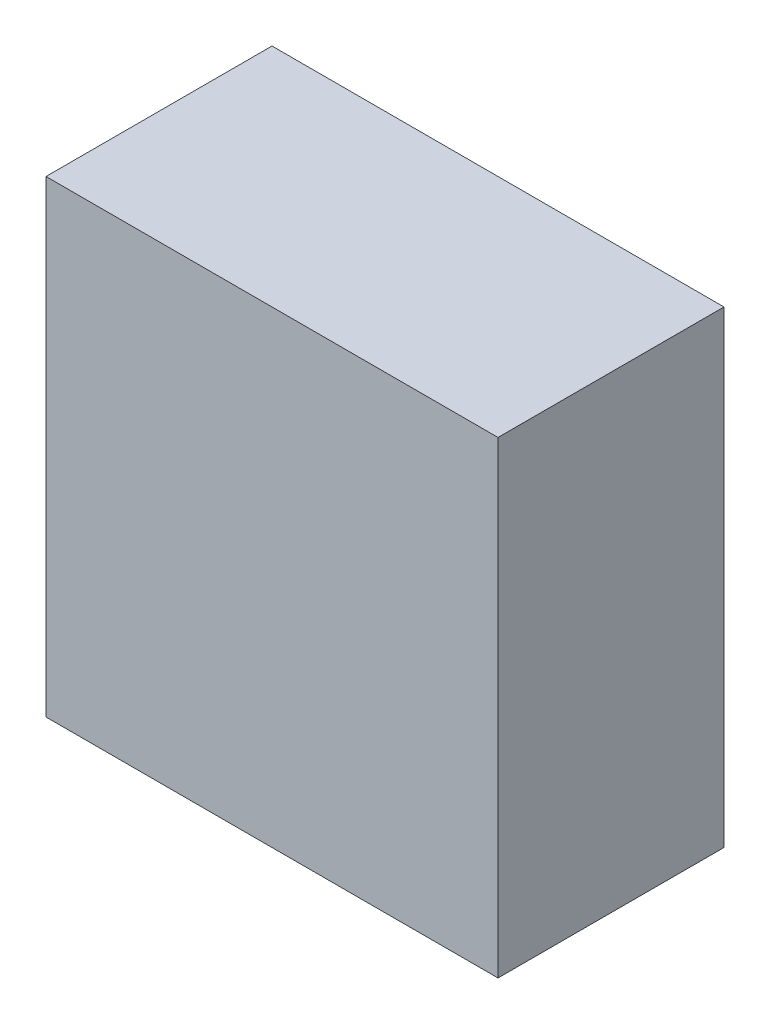
ISO-10303-21;
HEADER;
FILE_DESCRIPTION(('STEP AP214'),'2;1');
FILE_NAME('part.step','',(''),(''),'','','');
FILE_SCHEMA(('AUTOMOTIVE_DESIGN { 1 0 10303 214 1 1 1 1 }'));
ENDSEC;
DATA;
#1=APPLICATION_CONTEXT('core data for automotive mechanical design processes');
#2=APPLICATION_PROTOCOL_DEFINITION('international standard','automotive_design',2000,#1);
#3=PRODUCT_CONTEXT('',#1,'mechanical');
#4=PRODUCT('Part','Part','',(#3));
#5=PRODUCT_RELATED_PRODUCT_CATEGORY('part','',(#4));
#6=PRODUCT_DEFINITION_FORMATION('','',#4);
#7=PRODUCT_DEFINITION_CONTEXT('part definition',#1,'design');
#8=PRODUCT_DEFINITION('design','',#6,#7);
#9=PRODUCT_DEFINITION_SHAPE('','',#8);
#10=(LENGTH_UNIT() NAMED_UNIT(*) SI_UNIT(.MILLI.,.METRE.));
#11=(NAMED_UNIT(*) PLANE_ANGLE_UNIT() SI_UNIT($,.RADIAN.));
#12=(NAMED_UNIT(*) SI_UNIT($,.STERADIAN.) SOLID_ANGLE_UNIT());
#13=UNCERTAINTY_MEASURE_WITH_UNIT(LENGTH_MEASURE(1.E-05),#10,'distance_accuracy_value','');
#14=(GEOMETRIC_REPRESENTATION_CONTEXT(3) GLOBAL_UNCERTAINTY_ASSIGNED_CONTEXT((#13)) GLOBAL_UNIT_ASSIGNED_CONTEXT((#10,
#11,#12)) REPRESENTATION_CONTEXT('',''));
#15=CARTESIAN_POINT('',(0.,0.,0.));
#16=DIRECTION('',(0.,0.,1.));
#17=DIRECTION('',(1.,0.,0.));
#18=AXIS2_PLACEMENT_3D('',#15,#16,#17);
#19=CARTESIAN_POINT('',(-0.699986899587501,0.724992035723915,0.));
#20=DIRECTION('',(-1.,1.19248806385031E-08,0.));
#21=DIRECTION('',(-1.19248806385031E-08,-1.,0.));
#22=AXIS2_PLACEMENT_3D('',#19,#20,#21);
#23=PLANE('',#22);
#24=DIRECTION('',(-1.1924880607005E-08,-1.,0.));
#25=VECTOR('',#24,1.);
#26=CARTESIAN_POINT('',(-0.699986899587501,0.724992035723915,0.));
#27=LINE('',#26,#25);
#28=CARTESIAN_POINT('',(-0.699986899587501,0.724992035723915,0.));
#29=VERTEX_POINT('',#28);
#30=CARTESIAN_POINT('',(-0.699986916878544,-0.725004912518273,0.));
#31=VERTEX_POINT('',#30);
#32=EDGE_CURVE('E11',#29,#31,#27,.T.);
#33=ORIENTED_EDGE('',*,*,#32,.T.);
#34=DIRECTION('',(0.,0.,1.));
#35=VECTOR('',#34,1.);
#36=CARTESIAN_POINT('',(-0.699986916878541,-0.725004912518273,0.));
#37=LINE('',#36,#35);
#38=CARTESIAN_POINT('',(-0.699986916878544,-0.725004912518273,0.700001120567322));
#39=VERTEX_POINT('',#38);
#40=EDGE_CURVE('E88',#31,#39,#37,.T.);
#41=ORIENTED_EDGE('',*,*,#40,.T.);
#42=DIRECTION('',(-1.1924880607005E-08,-1.,0.));
#43=VECTOR('',#42,1.);
#44=CARTESIAN_POINT('',(-0.699986899587501,0.724992035723915,0.700001120567322));
#45=LINE('',#44,#43);
#46=CARTESIAN_POINT('',(-0.699986899587501,0.724992035723915,0.700001120567322));
#47=VERTEX_POINT('',#46);
#48=EDGE_CURVE('E83',#47,#39,#45,.T.);
#49=ORIENTED_EDGE('',*,*,#48,.F.);
#50=DIRECTION('',(0.,0.,1.));
#51=VECTOR('',#50,1.);
#52=CARTESIAN_POINT('',(-0.699986899587501,0.724992035723933,0.));
#53=LINE('',#52,#51);
#54=EDGE_CURVE('E72',#29,#47,#53,.T.);
#55=ORIENTED_EDGE('',*,*,#54,.F.);
#56=EDGE_LOOP('',(#33,#41,#49,#55));
#57=FACE_BOUND('',#56,.T.);
#58=ADVANCED_FACE('F17',(#57),#23,.T.);
#59=CARTESIAN_POINT('',(-0.699986916878544,-0.725004912518273,0.));
#60=DIRECTION('',(-1.19248806385031E-08,-1.,0.));
#61=DIRECTION('',(1.,-1.19248806385031E-08,0.));
#62=AXIS2_PLACEMENT_3D('',#59,#60,#61);
#63=PLANE('',#62);
#64=DIRECTION('',(1.,-1.1924880652559E-08,0.));
#65=VECTOR('',#64,1.);
#66=CARTESIAN_POINT('',(-0.699986916878544,-0.725004912518273,0.));
#67=LINE('',#66,#65);
#68=CARTESIAN_POINT('',(0.700006979605831,-0.725004929213014,0.));
#69=VERTEX_POINT('',#68);
#70=EDGE_CURVE('E24',#31,#69,#67,.T.);
#71=ORIENTED_EDGE('',*,*,#70,.T.);
#72=DIRECTION('',(0.,0.,1.));
#73=VECTOR('',#72,1.);
#74=CARTESIAN_POINT('',(0.700006979605831,-0.725004929213033,0.));
#75=LINE('',#74,#73);
#76=CARTESIAN_POINT('',(0.700006979605831,-0.725004929213014,0.700001120567322));
#77=VERTEX_POINT('',#76);
#78=EDGE_CURVE('E85',#69,#77,#75,.T.);
#79=ORIENTED_EDGE('',*,*,#78,.T.);
#80=DIRECTION('',(1.,-1.1924880652559E-08,0.));
#81=VECTOR('',#80,1.);
#82=CARTESIAN_POINT('',(-0.699986916878544,-0.725004912518273,0.700001120567322));
#83=LINE('',#82,#81);
#84=EDGE_CURVE('E66',#39,#77,#83,.T.);
#85=ORIENTED_EDGE('',*,*,#84,.F.);
#86=ORIENTED_EDGE('',*,*,#40,.F.);
#87=EDGE_LOOP('',(#71,#79,#85,#86));
#88=FACE_BOUND('',#87,.T.);
#89=ADVANCED_FACE('F89',(#88),#63,.T.);
#90=CARTESIAN_POINT('',(0.700006979605831,-0.725004929213014,0.));
#91=DIRECTION('',(1.,-1.19248806385031E-08,0.));
#92=DIRECTION('',(1.19248806385031E-08,1.,0.));
#93=AXIS2_PLACEMENT_3D('',#90,#91,#92);
#94=PLANE('',#93);
#95=DIRECTION('',(1.1924880607005E-08,1.,0.));
#96=VECTOR('',#95,1.);
#97=CARTESIAN_POINT('',(0.700006979605831,-0.725004929213014,0.));
#98=LINE('',#97,#96);
#99=CARTESIAN_POINT('',(0.700006996896874,0.724992019029173,0.));
#100=VERTEX_POINT('',#99);
#101=EDGE_CURVE('E62',#69,#100,#98,.T.);
#102=ORIENTED_EDGE('',*,*,#101,.T.);
#103=DIRECTION('',(0.,0.,1.));
#104=VECTOR('',#103,1.);
#105=CARTESIAN_POINT('',(0.700006996896872,0.724992019029173,0.));
#106=LINE('',#105,#104);
#107=CARTESIAN_POINT('',(0.700006996896874,0.724992019029173,0.700001120567322));
#108=VERTEX_POINT('',#107);
#109=EDGE_CURVE('E55',#100,#108,#106,.T.);
#110=ORIENTED_EDGE('',*,*,#109,.T.);
#111=DIRECTION('',(1.1924880607005E-08,1.,0.));
#112=VECTOR('',#111,1.);
#113=CARTESIAN_POINT('',(0.700006979605831,-0.725004929213014,0.700001120567322));
#114=LINE('',#113,#112);
#115=EDGE_CURVE('E59',#77,#108,#114,.T.);
#116=ORIENTED_EDGE('',*,*,#115,.F.);
#117=ORIENTED_EDGE('',*,*,#78,.F.);
#118=EDGE_LOOP('',(#102,#110,#116,#117));
#119=FACE_BOUND('',#118,.T.);
#120=ADVANCED_FACE('F57',(#119),#94,.T.);
#121=CARTESIAN_POINT('',(0.700006996896874,0.724992019029173,0.));
#122=DIRECTION('',(1.19248806385031E-08,1.,0.));
#123=DIRECTION('',(-1.,1.19248806385031E-08,0.));
#124=AXIS2_PLACEMENT_3D('',#121,#122,#123);
#125=PLANE('',#124);
#126=DIRECTION('',(-1.,1.1924880652559E-08,0.));
#127=VECTOR('',#126,1.);
#128=CARTESIAN_POINT('',(0.700006996896874,0.724992019029173,0.));
#129=LINE('',#128,#127);
#130=EDGE_CURVE('E65',#100,#29,#129,.T.);
#131=ORIENTED_EDGE('',*,*,#130,.T.);
#132=ORIENTED_EDGE('',*,*,#54,.T.);
#133=DIRECTION('',(-1.,1.1924880652559E-08,0.));
#134=VECTOR('',#133,1.);
#135=CARTESIAN_POINT('',(0.700006996896874,0.724992019029173,0.700001120567322));
#136=LINE('',#135,#134);
#137=EDGE_CURVE('E70',#108,#47,#136,.T.);
#138=ORIENTED_EDGE('',*,*,#137,.F.);
#139=ORIENTED_EDGE('',*,*,#109,.F.);
#140=EDGE_LOOP('',(#131,#132,#138,#139));
#141=FACE_BOUND('',#140,.T.);
#142=ADVANCED_FACE('F71',(#141),#125,.T.);
#143=CARTESIAN_POINT('',(99.1750030517578,-202.150009155273,0.700001120567322));
#144=DIRECTION('',(0.,0.,1.));
#145=DIRECTION('',(1.19248806385031E-08,1.,0.));
#146=AXIS2_PLACEMENT_3D('',#143,#144,#145);
#147=PLANE('',#146);
#148=ORIENTED_EDGE('',*,*,#48,.T.);
#149=ORIENTED_EDGE('',*,*,#84,.T.);
#150=ORIENTED_EDGE('',*,*,#115,.T.);
#151=ORIENTED_EDGE('',*,*,#137,.T.);
#152=EDGE_LOOP('',(#148,#149,#150,#151));
#153=FACE_BOUND('',#152,.T.);
#154=ADVANCED_FACE('F76',(#153),#147,.T.);
#155=CARTESIAN_POINT('',(99.1750030517578,-202.150009155273,0.));
#156=DIRECTION('',(0.,0.,1.));
#157=DIRECTION('',(1.19248806385031E-08,1.,0.));
#158=AXIS2_PLACEMENT_3D('',#155,#156,#157);
#159=PLANE('',#158);
#160=ORIENTED_EDGE('',*,*,#130,.F.);
#161=ORIENTED_EDGE('',*,*,#101,.F.);
#162=ORIENTED_EDGE('',*,*,#70,.F.);
#163=ORIENTED_EDGE('',*,*,#32,.F.);
#164=EDGE_LOOP('',(#160,#161,#162,#163));
#165=FACE_BOUND('',#164,.T.);
#166=ADVANCED_FACE('F91',(#165),#159,.F.);
#167=CLOSED_SHELL('',(#58,#89,#120,#142,#154,#166));
#168=MANIFOLD_SOLID_BREP('B1',#167);
#169=ADVANCED_BREP_SHAPE_REPRESENTATION('',(#18,#168),#14);
#170=SHAPE_DEFINITION_REPRESENTATION(#9,#169);
ENDSEC;
END-ISO-10303-21;
